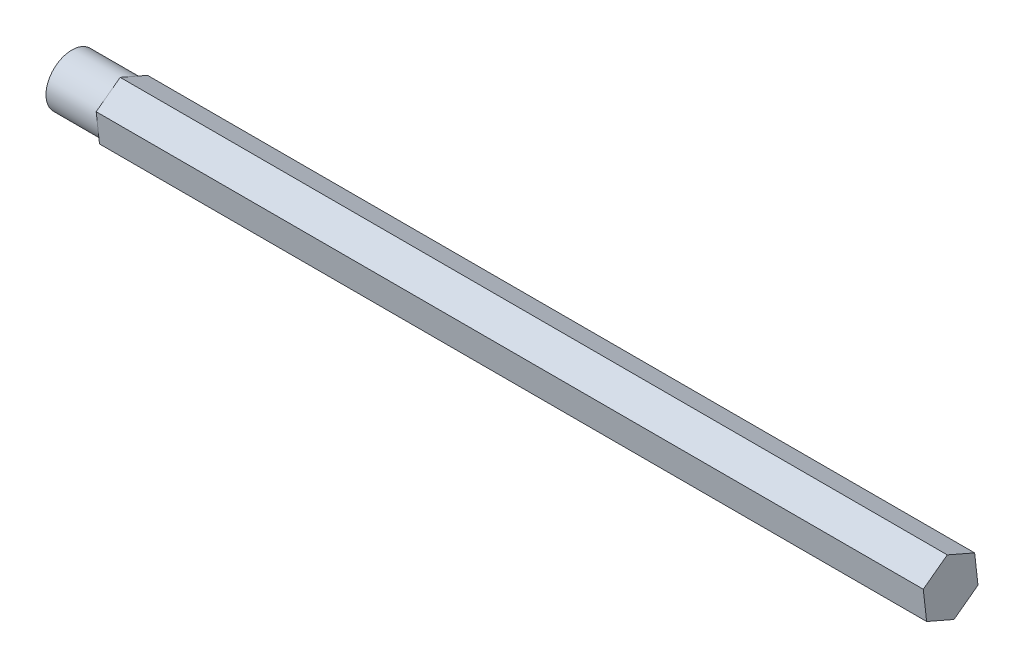
ISO-10303-21;
HEADER;
FILE_DESCRIPTION(('STEP AP214'),'2;1');
FILE_NAME('part.step','',(''),(''),'','','');
FILE_SCHEMA(('AUTOMOTIVE_DESIGN { 1 0 10303 214 1 1 1 1 }'));
ENDSEC;
DATA;
#1=APPLICATION_CONTEXT('core data for automotive mechanical design processes');
#2=APPLICATION_PROTOCOL_DEFINITION('international standard','automotive_design',2000,#1);
#3=PRODUCT_CONTEXT('',#1,'mechanical');
#4=PRODUCT('Part','Part','',(#3));
#5=PRODUCT_RELATED_PRODUCT_CATEGORY('part','',(#4));
#6=PRODUCT_DEFINITION_FORMATION('','',#4);
#7=PRODUCT_DEFINITION_CONTEXT('part definition',#1,'design');
#8=PRODUCT_DEFINITION('design','',#6,#7);
#9=PRODUCT_DEFINITION_SHAPE('','',#8);
#10=(LENGTH_UNIT() NAMED_UNIT(*) SI_UNIT(.MILLI.,.METRE.));
#11=(NAMED_UNIT(*) PLANE_ANGLE_UNIT() SI_UNIT($,.RADIAN.));
#12=(NAMED_UNIT(*) SI_UNIT($,.STERADIAN.) SOLID_ANGLE_UNIT());
#13=UNCERTAINTY_MEASURE_WITH_UNIT(LENGTH_MEASURE(1.E-05),#10,'distance_accuracy_value','');
#14=(GEOMETRIC_REPRESENTATION_CONTEXT(3) GLOBAL_UNCERTAINTY_ASSIGNED_CONTEXT((#13)) GLOBAL_UNIT_ASSIGNED_CONTEXT((#10,
#11,#12)) REPRESENTATION_CONTEXT('',''));
#15=CARTESIAN_POINT('',(0.,0.,0.));
#16=DIRECTION('',(0.,0.,1.));
#17=DIRECTION('',(1.,0.,0.));
#18=AXIS2_PLACEMENT_3D('',#15,#16,#17);
#19=CARTESIAN_POINT('',(0.,0.,0.));
#20=DIRECTION('',(1.,0.,0.));
#21=DIRECTION('',(0.,0.,-1.));
#22=AXIS2_PLACEMENT_3D('',#19,#20,#21);
#23=PLANE('',#22);
#24=CARTESIAN_POINT('',(0.,0.,0.));
#25=DIRECTION('',(-1.,0.,0.));
#26=DIRECTION('',(0.,0.,1.));
#27=AXIS2_PLACEMENT_3D('',#24,#25,#26);
#28=CIRCLE('',#27,6.35);
#29=CARTESIAN_POINT('',(0.,5.10746926770189,3.77309656376307));
#30=VERTEX_POINT('',#29);
#31=CARTESIAN_POINT('',(0.,5.82133210900156,-2.53664985299661));
#32=VERTEX_POINT('',#31);
#33=EDGE_CURVE('E50',#30,#32,#28,.T.);
#34=ORIENTED_EDGE('',*,*,#33,.F.);
#35=DIRECTION('',(0.,-0.594188435238279,0.804325868929431));
#36=VECTOR('',#35,1.);
#37=CARTESIAN_POINT('',(0.,7.28586758446898,0.824297807177649));
#38=LINE('',#37,#36);
#39=CARTESIAN_POINT('',(0.,7.28586758446898,0.824297807177649));
#40=VERTEX_POINT('',#39);
#41=EDGE_CURVE('E116',#40,#30,#38,.T.);
#42=ORIENTED_EDGE('',*,*,#41,.F.);
#43=DIRECTION('',(0.,0.399472417794741,0.91674521401599));
#44=VECTOR('',#43,1.);
#45=CARTESIAN_POINT('',(0.,4.35679663353414,-5.89759751317087));
#46=LINE('',#45,#44);
#47=EDGE_CURVE('E139',#32,#40,#46,.T.);
#48=ORIENTED_EDGE('',*,*,#47,.F.);
#49=EDGE_LOOP('',(#34,#42,#48));
#50=FACE_BOUND('',#49,.T.);
#51=ADVANCED_FACE('F38',(#50),#23,.F.);
#52=CARTESIAN_POINT('',(0.,0.71386284129965,-6.3097464167597));
#53=VERTEX_POINT('',#52);
#54=EDGE_CURVE('E11',#32,#53,#28,.T.);
#55=ORIENTED_EDGE('',*,*,#54,.F.);
#56=CARTESIAN_POINT('',(0.,4.35679663353414,-5.89759751317087));
#57=VERTEX_POINT('',#56);
#58=EDGE_CURVE('E137',#57,#32,#46,.T.);
#59=ORIENTED_EDGE('',*,*,#58,.F.);
#60=DIRECTION('',(0.,0.99366085303302,0.112419345086559));
#61=VECTOR('',#60,1.);
#62=CARTESIAN_POINT('',(0.,-2.92907095093484,-6.72189532034852));
#63=LINE('',#62,#61);
#64=EDGE_CURVE('E172',#53,#57,#63,.T.);
#65=ORIENTED_EDGE('',*,*,#64,.F.);
#66=EDGE_LOOP('',(#55,#59,#65));
#67=FACE_BOUND('',#66,.T.);
#68=ADVANCED_FACE('F201',(#67),#23,.F.);
#69=CARTESIAN_POINT('',(0.,-5.10746926770191,-3.77309656376309));
#70=VERTEX_POINT('',#69);
#71=EDGE_CURVE('E48',#53,#70,#28,.T.);
#72=ORIENTED_EDGE('',*,*,#71,.F.);
#73=CARTESIAN_POINT('',(0.,-2.92907095093484,-6.72189532034852));
#74=VERTEX_POINT('',#73);
#75=EDGE_CURVE('E174',#74,#53,#63,.T.);
#76=ORIENTED_EDGE('',*,*,#75,.F.);
#77=DIRECTION('',(0.,0.594188435238279,-0.804325868929432));
#78=VECTOR('',#77,1.);
#79=CARTESIAN_POINT('',(0.,-7.28586758446898,-0.824297807177653));
#80=LINE('',#79,#78);
#81=EDGE_CURVE('E173',#70,#74,#80,.T.);
#82=ORIENTED_EDGE('',*,*,#81,.F.);
#83=EDGE_LOOP('',(#72,#76,#82));
#84=FACE_BOUND('',#83,.T.);
#85=ADVANCED_FACE('F216',(#84),#23,.F.);
#86=CARTESIAN_POINT('',(0.,-5.82133210900156,2.53664985299661));
#87=VERTEX_POINT('',#86);
#88=EDGE_CURVE('E147',#70,#87,#28,.T.);
#89=ORIENTED_EDGE('',*,*,#88,.F.);
#90=CARTESIAN_POINT('',(0.,-7.28586758446898,-0.824297807177653));
#91=VERTEX_POINT('',#90);
#92=EDGE_CURVE('E168',#91,#70,#80,.T.);
#93=ORIENTED_EDGE('',*,*,#92,.F.);
#94=DIRECTION('',(0.,-0.399472417794741,-0.91674521401599));
#95=VECTOR('',#94,1.);
#96=CARTESIAN_POINT('',(0.,-4.35679663353414,5.89759751317087));
#97=LINE('',#96,#95);
#98=EDGE_CURVE('E180',#87,#91,#97,.T.);
#99=ORIENTED_EDGE('',*,*,#98,.F.);
#100=EDGE_LOOP('',(#89,#93,#99));
#101=FACE_BOUND('',#100,.T.);
#102=ADVANCED_FACE('F218',(#101),#23,.F.);
#103=CARTESIAN_POINT('',(0.,-0.713862841299647,6.3097464167597));
#104=VERTEX_POINT('',#103);
#105=EDGE_CURVE('E146',#87,#104,#28,.T.);
#106=ORIENTED_EDGE('',*,*,#105,.F.);
#107=CARTESIAN_POINT('',(0.,-4.35679663353414,5.89759751317087));
#108=VERTEX_POINT('',#107);
#109=EDGE_CURVE('E157',#108,#87,#97,.T.);
#110=ORIENTED_EDGE('',*,*,#109,.F.);
#111=DIRECTION('',(0.,-0.99366085303302,-0.112419345086558));
#112=VECTOR('',#111,1.);
#113=CARTESIAN_POINT('',(0.,2.92907095093485,6.72189532034852));
#114=LINE('',#113,#112);
#115=EDGE_CURVE('E127',#104,#108,#114,.T.);
#116=ORIENTED_EDGE('',*,*,#115,.F.);
#117=EDGE_LOOP('',(#106,#110,#116));
#118=FACE_BOUND('',#117,.T.);
#119=ADVANCED_FACE('F224',(#118),#23,.F.);
#120=CARTESIAN_POINT('',(203.2,-7.28586758446898,-0.824297807177653));
#121=DIRECTION('',(0.,0.804325868929432,0.594188435238279));
#122=DIRECTION('',(0.,-0.594188435238279,0.804325868929432));
#123=AXIS2_PLACEMENT_3D('',#120,#121,#122);
#124=PLANE('',#123);
#125=ORIENTED_EDGE('',*,*,#92,.T.);
#126=ORIENTED_EDGE('',*,*,#81,.T.);
#127=DIRECTION('',(-1.,0.,0.));
#128=VECTOR('',#127,1.);
#129=CARTESIAN_POINT('',(203.2,-2.92907095093484,-6.72189532034852));
#130=LINE('',#129,#128);
#131=CARTESIAN_POINT('',(203.2,-2.92907095093484,-6.72189532034852));
#132=VERTEX_POINT('',#131);
#133=EDGE_CURVE('E42',#132,#74,#130,.T.);
#134=ORIENTED_EDGE('',*,*,#133,.F.);
#135=DIRECTION('',(0.,0.594188435238279,-0.804325868929432));
#136=VECTOR('',#135,1.);
#137=CARTESIAN_POINT('',(203.2,-7.28586758446898,-0.824297807177653));
#138=LINE('',#137,#136);
#139=CARTESIAN_POINT('',(203.2,-7.28586758446898,-0.824297807177653));
#140=VERTEX_POINT('',#139);
#141=EDGE_CURVE('E153',#140,#132,#138,.T.);
#142=ORIENTED_EDGE('',*,*,#141,.F.);
#143=DIRECTION('',(-1.,0.,0.));
#144=VECTOR('',#143,1.);
#145=CARTESIAN_POINT('',(203.2,-7.28586758446898,-0.824297807177653));
#146=LINE('',#145,#144);
#147=EDGE_CURVE('E167',#140,#91,#146,.T.);
#148=ORIENTED_EDGE('',*,*,#147,.T.);
#149=EDGE_LOOP('',(#125,#126,#134,#142,#148));
#150=FACE_BOUND('',#149,.T.);
#151=ADVANCED_FACE('F40',(#150),#124,.F.);
#152=CARTESIAN_POINT('',(203.2,-2.92907095093484,-6.72189532034852));
#153=DIRECTION('',(0.,-0.112419345086559,0.99366085303302));
#154=DIRECTION('',(0.,-0.99366085303302,-0.112419345086559));
#155=AXIS2_PLACEMENT_3D('',#152,#153,#154);
#156=PLANE('',#155);
#157=ORIENTED_EDGE('',*,*,#75,.T.);
#158=ORIENTED_EDGE('',*,*,#64,.T.);
#159=DIRECTION('',(-1.,0.,0.));
#160=VECTOR('',#159,1.);
#161=CARTESIAN_POINT('',(203.2,4.35679663353414,-5.89759751317087));
#162=LINE('',#161,#160);
#163=CARTESIAN_POINT('',(203.2,4.35679663353414,-5.89759751317087));
#164=VERTEX_POINT('',#163);
#165=EDGE_CURVE('E150',#164,#57,#162,.T.);
#166=ORIENTED_EDGE('',*,*,#165,.F.);
#167=DIRECTION('',(0.,0.99366085303302,0.112419345086559));
#168=VECTOR('',#167,1.);
#169=CARTESIAN_POINT('',(203.2,-2.92907095093484,-6.72189532034852));
#170=LINE('',#169,#168);
#171=EDGE_CURVE('E156',#132,#164,#170,.T.);
#172=ORIENTED_EDGE('',*,*,#171,.F.);
#173=ORIENTED_EDGE('',*,*,#133,.T.);
#174=EDGE_LOOP('',(#157,#158,#166,#172,#173));
#175=FACE_BOUND('',#174,.T.);
#176=ADVANCED_FACE('F203',(#175),#156,.F.);
#177=CARTESIAN_POINT('',(203.2,4.35679663353414,-5.89759751317087));
#178=DIRECTION('',(0.,-0.91674521401599,0.399472417794741));
#179=DIRECTION('',(0.,-0.399472417794741,-0.916745214015991));
#180=AXIS2_PLACEMENT_3D('',#177,#178,#179);
#181=PLANE('',#180);
#182=ORIENTED_EDGE('',*,*,#58,.T.);
#183=ORIENTED_EDGE('',*,*,#47,.T.);
#184=DIRECTION('',(-1.,0.,0.));
#185=VECTOR('',#184,1.);
#186=CARTESIAN_POINT('',(203.2,7.28586758446898,0.824297807177649));
#187=LINE('',#186,#185);
#188=CARTESIAN_POINT('',(203.2,7.28586758446898,0.824297807177649));
#189=VERTEX_POINT('',#188);
#190=EDGE_CURVE('E124',#189,#40,#187,.T.);
#191=ORIENTED_EDGE('',*,*,#190,.F.);
#192=DIRECTION('',(0.,0.399472417794741,0.91674521401599));
#193=VECTOR('',#192,1.);
#194=CARTESIAN_POINT('',(203.2,4.35679663353414,-5.89759751317087));
#195=LINE('',#194,#193);
#196=EDGE_CURVE('E159',#164,#189,#195,.T.);
#197=ORIENTED_EDGE('',*,*,#196,.F.);
#198=ORIENTED_EDGE('',*,*,#165,.T.);
#199=EDGE_LOOP('',(#182,#183,#191,#197,#198));
#200=FACE_BOUND('',#199,.T.);
#201=ADVANCED_FACE('F199',(#200),#181,.F.);
#202=CARTESIAN_POINT('',(203.2,7.28586758446898,0.824297807177649));
#203=DIRECTION('',(0.,-0.804325868929431,-0.594188435238279));
#204=DIRECTION('',(0.,0.594188435238279,-0.804325868929431));
#205=AXIS2_PLACEMENT_3D('',#202,#203,#204);
#206=PLANE('',#205);
#207=ORIENTED_EDGE('',*,*,#41,.T.);
#208=CARTESIAN_POINT('',(0.,2.92907095093485,6.72189532034852));
#209=VERTEX_POINT('',#208);
#210=EDGE_CURVE('E120',#30,#209,#38,.T.);
#211=ORIENTED_EDGE('',*,*,#210,.T.);
#212=DIRECTION('',(-1.,0.,0.));
#213=VECTOR('',#212,1.);
#214=CARTESIAN_POINT('',(203.2,2.92907095093485,6.72189532034852));
#215=LINE('',#214,#213);
#216=CARTESIAN_POINT('',(203.2,2.92907095093485,6.72189532034852));
#217=VERTEX_POINT('',#216);
#218=EDGE_CURVE('E190',#217,#209,#215,.T.);
#219=ORIENTED_EDGE('',*,*,#218,.F.);
#220=DIRECTION('',(0.,-0.594188435238279,0.804325868929431));
#221=VECTOR('',#220,1.);
#222=CARTESIAN_POINT('',(203.2,7.28586758446898,0.824297807177649));
#223=LINE('',#222,#221);
#224=EDGE_CURVE('E161',#189,#217,#223,.T.);
#225=ORIENTED_EDGE('',*,*,#224,.F.);
#226=ORIENTED_EDGE('',*,*,#190,.T.);
#227=EDGE_LOOP('',(#207,#211,#219,#225,#226));
#228=FACE_BOUND('',#227,.T.);
#229=ADVANCED_FACE('F118',(#228),#206,.F.);
#230=CARTESIAN_POINT('',(203.2,2.92907095093485,6.72189532034852));
#231=DIRECTION('',(0.,0.112419345086558,-0.99366085303302));
#232=DIRECTION('',(0.,0.99366085303302,0.112419345086558));
#233=AXIS2_PLACEMENT_3D('',#230,#231,#232);
#234=PLANE('',#233);
#235=EDGE_CURVE('E136',#209,#104,#114,.T.);
#236=ORIENTED_EDGE('',*,*,#235,.T.);
#237=ORIENTED_EDGE('',*,*,#115,.T.);
#238=DIRECTION('',(-1.,0.,0.));
#239=VECTOR('',#238,1.);
#240=CARTESIAN_POINT('',(203.2,-4.35679663353414,5.89759751317087));
#241=LINE('',#240,#239);
#242=CARTESIAN_POINT('',(203.2,-4.35679663353414,5.89759751317087));
#243=VERTEX_POINT('',#242);
#244=EDGE_CURVE('E186',#243,#108,#241,.T.);
#245=ORIENTED_EDGE('',*,*,#244,.F.);
#246=DIRECTION('',(0.,-0.99366085303302,-0.112419345086558));
#247=VECTOR('',#246,1.);
#248=CARTESIAN_POINT('',(203.2,2.92907095093485,6.72189532034852));
#249=LINE('',#248,#247);
#250=EDGE_CURVE('E163',#217,#243,#249,.T.);
#251=ORIENTED_EDGE('',*,*,#250,.F.);
#252=ORIENTED_EDGE('',*,*,#218,.T.);
#253=EDGE_LOOP('',(#236,#237,#245,#251,#252));
#254=FACE_BOUND('',#253,.T.);
#255=ADVANCED_FACE('F255',(#254),#234,.F.);
#256=CARTESIAN_POINT('',(203.2,-4.35679663353414,5.89759751317087));
#257=DIRECTION('',(0.,0.91674521401599,-0.399472417794741));
#258=DIRECTION('',(0.,0.399472417794741,0.91674521401599));
#259=AXIS2_PLACEMENT_3D('',#256,#257,#258);
#260=PLANE('',#259);
#261=ORIENTED_EDGE('',*,*,#109,.T.);
#262=ORIENTED_EDGE('',*,*,#98,.T.);
#263=ORIENTED_EDGE('',*,*,#147,.F.);
#264=DIRECTION('',(0.,-0.399472417794741,-0.91674521401599));
#265=VECTOR('',#264,1.);
#266=CARTESIAN_POINT('',(203.2,-4.35679663353414,5.89759751317087));
#267=LINE('',#266,#265);
#268=EDGE_CURVE('E165',#243,#140,#267,.T.);
#269=ORIENTED_EDGE('',*,*,#268,.F.);
#270=ORIENTED_EDGE('',*,*,#244,.T.);
#271=EDGE_LOOP('',(#261,#262,#263,#269,#270));
#272=FACE_BOUND('',#271,.T.);
#273=ADVANCED_FACE('F240',(#272),#260,.F.);
#274=CARTESIAN_POINT('',(203.2,0.,0.));
#275=DIRECTION('',(1.,0.,0.));
#276=DIRECTION('',(0.,0.,-1.));
#277=AXIS2_PLACEMENT_3D('',#274,#275,#276);
#278=PLANE('',#277);
#279=ORIENTED_EDGE('',*,*,#141,.T.);
#280=ORIENTED_EDGE('',*,*,#171,.T.);
#281=ORIENTED_EDGE('',*,*,#196,.T.);
#282=ORIENTED_EDGE('',*,*,#224,.T.);
#283=ORIENTED_EDGE('',*,*,#250,.T.);
#284=ORIENTED_EDGE('',*,*,#268,.T.);
#285=EDGE_LOOP('',(#279,#280,#281,#282,#283,#284));
#286=FACE_BOUND('',#285,.T.);
#287=ADVANCED_FACE('F232',(#286),#278,.T.);
#288=EDGE_CURVE('E133',#104,#30,#28,.T.);
#289=ORIENTED_EDGE('',*,*,#288,.F.);
#290=ORIENTED_EDGE('',*,*,#235,.F.);
#291=ORIENTED_EDGE('',*,*,#210,.F.);
#292=EDGE_LOOP('',(#289,#290,#291));
#293=FACE_BOUND('',#292,.T.);
#294=ADVANCED_FACE('F131',(#293),#23,.F.);
#295=CARTESIAN_POINT('',(-12.7,0.,0.));
#296=DIRECTION('',(1.,0.,0.));
#297=DIRECTION('',(0.,0.,-1.));
#298=AXIS2_PLACEMENT_3D('',#295,#296,#297);
#299=CYLINDRICAL_SURFACE('',#298,6.35);
#300=CARTESIAN_POINT('',(-12.7,0.,0.));
#301=DIRECTION('',(-1.,0.,0.));
#302=DIRECTION('',(0.,0.,1.));
#303=AXIS2_PLACEMENT_3D('',#300,#301,#302);
#304=CIRCLE('',#303,6.35);
#305=CARTESIAN_POINT('',(-12.7,0.,6.35));
#306=VERTEX_POINT('',#305);
#307=EDGE_CURVE('E142',#306,#306,#304,.T.);
#308=ORIENTED_EDGE('',*,*,#307,.F.);
#309=EDGE_LOOP('',(#308));
#310=FACE_BOUND('',#309,.T.);
#311=ORIENTED_EDGE('',*,*,#33,.T.);
#312=ORIENTED_EDGE('',*,*,#54,.T.);
#313=ORIENTED_EDGE('',*,*,#71,.T.);
#314=ORIENTED_EDGE('',*,*,#88,.T.);
#315=ORIENTED_EDGE('',*,*,#105,.T.);
#316=ORIENTED_EDGE('',*,*,#288,.T.);
#317=EDGE_LOOP('',(#311,#312,#313,#314,#315,#316));
#318=FACE_BOUND('',#317,.T.);
#319=ADVANCED_FACE('F144',(#310,#318),#299,.T.);
#320=CARTESIAN_POINT('',(-12.7,0.,0.));
#321=DIRECTION('',(-1.,0.,0.));
#322=DIRECTION('',(0.,0.,1.));
#323=AXIS2_PLACEMENT_3D('',#320,#321,#322);
#324=PLANE('',#323);
#325=ORIENTED_EDGE('',*,*,#307,.T.);
#326=EDGE_LOOP('',(#325));
#327=FACE_BOUND('',#326,.T.);
#328=ADVANCED_FACE('F237',(#327),#324,.T.);
#329=CLOSED_SHELL('',(#51,#68,#85,#102,#119,#151,#176,#201,#229,#255,#273,#287,#294,#319,#328));
#330=MANIFOLD_SOLID_BREP('B2',#329);
#331=ADVANCED_BREP_SHAPE_REPRESENTATION('',(#18,#330),#14);
#332=SHAPE_DEFINITION_REPRESENTATION(#9,#331);
ENDSEC;
END-ISO-10303-21;
